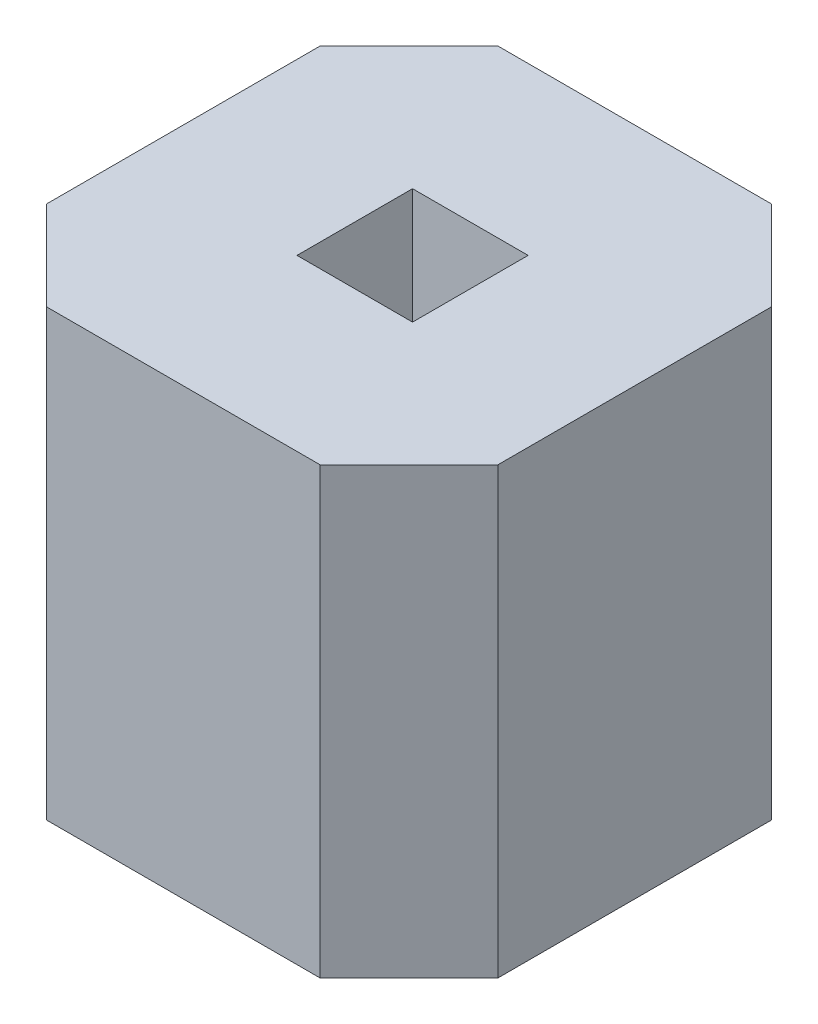
ISO-10303-21;
HEADER;
FILE_DESCRIPTION(('STEP AP214'),'2;1');
FILE_NAME('part.step','',(''),(''),'','','');
FILE_SCHEMA(('AUTOMOTIVE_DESIGN { 1 0 10303 214 1 1 1 1 }'));
ENDSEC;
DATA;
#1=APPLICATION_CONTEXT('core data for automotive mechanical design processes');
#2=APPLICATION_PROTOCOL_DEFINITION('international standard','automotive_design',2000,#1);
#3=PRODUCT_CONTEXT('',#1,'mechanical');
#4=PRODUCT('Part','Part','',(#3));
#5=PRODUCT_RELATED_PRODUCT_CATEGORY('part','',(#4));
#6=PRODUCT_DEFINITION_FORMATION('','',#4);
#7=PRODUCT_DEFINITION_CONTEXT('part definition',#1,'design');
#8=PRODUCT_DEFINITION('design','',#6,#7);
#9=PRODUCT_DEFINITION_SHAPE('','',#8);
#10=(LENGTH_UNIT() NAMED_UNIT(*) SI_UNIT(.MILLI.,.METRE.));
#11=(NAMED_UNIT(*) PLANE_ANGLE_UNIT() SI_UNIT($,.RADIAN.));
#12=(NAMED_UNIT(*) SI_UNIT($,.STERADIAN.) SOLID_ANGLE_UNIT());
#13=UNCERTAINTY_MEASURE_WITH_UNIT(LENGTH_MEASURE(1.E-05),#10,'distance_accuracy_value','');
#14=(GEOMETRIC_REPRESENTATION_CONTEXT(3) GLOBAL_UNCERTAINTY_ASSIGNED_CONTEXT((#13)) GLOBAL_UNIT_ASSIGNED_CONTEXT((#10,
#11,#12)) REPRESENTATION_CONTEXT('',''));
#15=CARTESIAN_POINT('',(0.,0.,0.));
#16=DIRECTION('',(0.,0.,1.));
#17=DIRECTION('',(1.,0.,0.));
#18=AXIS2_PLACEMENT_3D('',#15,#16,#17);
#19=CARTESIAN_POINT('',(2.54,2.5,-2.54));
#20=DIRECTION('',(0.,1.,0.));
#21=DIRECTION('',(0.,0.,1.));
#22=AXIS2_PLACEMENT_3D('',#19,#20,#21);
#23=PLANE('',#22);
#24=DIRECTION('',(-1.,0.,0.));
#25=VECTOR('',#24,1.);
#26=CARTESIAN_POINT('',(0.5,2.5,-2.54));
#27=LINE('',#26,#25);
#28=CARTESIAN_POINT('',(2.04,2.5,-2.54));
#29=VERTEX_POINT('',#28);
#30=CARTESIAN_POINT('',(0.5,2.5,-2.54));
#31=VERTEX_POINT('',#30);
#32=EDGE_CURVE('E157',#29,#31,#27,.T.);
#33=ORIENTED_EDGE('',*,*,#32,.T.);
#34=DIRECTION('',(-0.707106781186548,0.,0.707106781186548));
#35=VECTOR('',#34,1.);
#36=CARTESIAN_POINT('',(0.,2.5,-2.04));
#37=LINE('',#36,#35);
#38=CARTESIAN_POINT('',(0.,2.5,-2.04));
#39=VERTEX_POINT('',#38);
#40=EDGE_CURVE('E160',#31,#39,#37,.T.);
#41=ORIENTED_EDGE('',*,*,#40,.T.);
#42=DIRECTION('',(0.,0.,1.));
#43=VECTOR('',#42,1.);
#44=CARTESIAN_POINT('',(0.,2.5,-0.5));
#45=LINE('',#44,#43);
#46=CARTESIAN_POINT('',(0.,2.5,-0.5));
#47=VERTEX_POINT('',#46);
#48=EDGE_CURVE('E163',#39,#47,#45,.T.);
#49=ORIENTED_EDGE('',*,*,#48,.T.);
#50=DIRECTION('',(0.707106781186548,0.,0.707106781186548));
#51=VECTOR('',#50,1.);
#52=CARTESIAN_POINT('',(0.5,2.5,0.));
#53=LINE('',#52,#51);
#54=CARTESIAN_POINT('',(0.5,2.5,0.));
#55=VERTEX_POINT('',#54);
#56=EDGE_CURVE('E165',#47,#55,#53,.T.);
#57=ORIENTED_EDGE('',*,*,#56,.T.);
#58=DIRECTION('',(1.,0.,0.));
#59=VECTOR('',#58,1.);
#60=CARTESIAN_POINT('',(0.5,2.5,0.));
#61=LINE('',#60,#59);
#62=CARTESIAN_POINT('',(2.04,2.5,0.));
#63=VERTEX_POINT('',#62);
#64=EDGE_CURVE('E167',#55,#63,#61,.T.);
#65=ORIENTED_EDGE('',*,*,#64,.T.);
#66=DIRECTION('',(0.707106781186548,0.,-0.707106781186548));
#67=VECTOR('',#66,1.);
#68=CARTESIAN_POINT('',(2.04,2.5,0.));
#69=LINE('',#68,#67);
#70=CARTESIAN_POINT('',(2.54,2.5,-0.5));
#71=VERTEX_POINT('',#70);
#72=EDGE_CURVE('E169',#63,#71,#69,.T.);
#73=ORIENTED_EDGE('',*,*,#72,.T.);
#74=DIRECTION('',(0.,0.,-1.));
#75=VECTOR('',#74,1.);
#76=CARTESIAN_POINT('',(2.54,2.5,-0.5));
#77=LINE('',#76,#75);
#78=CARTESIAN_POINT('',(2.54,2.5,-2.04));
#79=VERTEX_POINT('',#78);
#80=EDGE_CURVE('E171',#71,#79,#77,.T.);
#81=ORIENTED_EDGE('',*,*,#80,.T.);
#82=DIRECTION('',(-0.707106781186548,0.,-0.707106781186548));
#83=VECTOR('',#82,1.);
#84=CARTESIAN_POINT('',(2.54,2.5,-2.04));
#85=LINE('',#84,#83);
#86=EDGE_CURVE('E173',#79,#29,#85,.T.);
#87=ORIENTED_EDGE('',*,*,#86,.T.);
#88=EDGE_LOOP('',(#33,#41,#49,#57,#65,#73,#81,#87));
#89=FACE_BOUND('',#88,.T.);
#90=DIRECTION('',(1.,0.,0.));
#91=VECTOR('',#90,1.);
#92=CARTESIAN_POINT('',(0.955,2.5,-0.955));
#93=LINE('',#92,#91);
#94=CARTESIAN_POINT('',(0.955,2.5,-0.955));
#95=VERTEX_POINT('',#94);
#96=CARTESIAN_POINT('',(1.605,2.5,-0.955));
#97=VERTEX_POINT('',#96);
#98=EDGE_CURVE('E129',#95,#97,#93,.T.);
#99=ORIENTED_EDGE('',*,*,#98,.F.);
#100=DIRECTION('',(0.,0.,1.));
#101=VECTOR('',#100,1.);
#102=CARTESIAN_POINT('',(0.955,2.5,-1.605));
#103=LINE('',#102,#101);
#104=CARTESIAN_POINT('',(0.955,2.5,-1.605));
#105=VERTEX_POINT('',#104);
#106=EDGE_CURVE('E121',#105,#95,#103,.T.);
#107=ORIENTED_EDGE('',*,*,#106,.F.);
#108=DIRECTION('',(-1.,0.,0.));
#109=VECTOR('',#108,1.);
#110=CARTESIAN_POINT('',(0.955,2.5,-1.605));
#111=LINE('',#110,#109);
#112=CARTESIAN_POINT('',(1.605,2.5,-1.605));
#113=VERTEX_POINT('',#112);
#114=EDGE_CURVE('E143',#113,#105,#111,.T.);
#115=ORIENTED_EDGE('',*,*,#114,.F.);
#116=DIRECTION('',(0.,0.,-1.));
#117=VECTOR('',#116,1.);
#118=CARTESIAN_POINT('',(1.605,2.5,-1.605));
#119=LINE('',#118,#117);
#120=EDGE_CURVE('E141',#97,#113,#119,.T.);
#121=ORIENTED_EDGE('',*,*,#120,.F.);
#122=EDGE_LOOP('',(#99,#107,#115,#121));
#123=FACE_BOUND('',#122,.T.);
#124=ADVANCED_FACE('F32',(#89,#123),#23,.T.);
#125=CARTESIAN_POINT('',(2.54,0.,-2.54));
#126=DIRECTION('',(0.,1.,0.));
#127=DIRECTION('',(0.,0.,1.));
#128=AXIS2_PLACEMENT_3D('',#125,#126,#127);
#129=PLANE('',#128);
#130=DIRECTION('',(-1.,0.,0.));
#131=VECTOR('',#130,1.);
#132=CARTESIAN_POINT('',(0.5,0.,-2.54));
#133=LINE('',#132,#131);
#134=CARTESIAN_POINT('',(2.04,0.,-2.54));
#135=VERTEX_POINT('',#134);
#136=CARTESIAN_POINT('',(0.5,0.,-2.54));
#137=VERTEX_POINT('',#136);
#138=EDGE_CURVE('E137',#135,#137,#133,.T.);
#139=ORIENTED_EDGE('',*,*,#138,.F.);
#140=DIRECTION('',(-0.707106781186548,0.,-0.707106781186548));
#141=VECTOR('',#140,1.);
#142=CARTESIAN_POINT('',(2.54,0.,-2.04));
#143=LINE('',#142,#141);
#144=CARTESIAN_POINT('',(2.54,0.,-2.04));
#145=VERTEX_POINT('',#144);
#146=EDGE_CURVE('E161',#145,#135,#143,.T.);
#147=ORIENTED_EDGE('',*,*,#146,.F.);
#148=DIRECTION('',(0.,0.,-1.));
#149=VECTOR('',#148,1.);
#150=CARTESIAN_POINT('',(2.54,0.,-0.5));
#151=LINE('',#150,#149);
#152=CARTESIAN_POINT('',(2.54,0.,-0.5));
#153=VERTEX_POINT('',#152);
#154=EDGE_CURVE('E188',#153,#145,#151,.T.);
#155=ORIENTED_EDGE('',*,*,#154,.F.);
#156=DIRECTION('',(0.707106781186548,0.,-0.707106781186548));
#157=VECTOR('',#156,1.);
#158=CARTESIAN_POINT('',(2.04,0.,0.));
#159=LINE('',#158,#157);
#160=CARTESIAN_POINT('',(2.04,0.,0.));
#161=VERTEX_POINT('',#160);
#162=EDGE_CURVE('E186',#161,#153,#159,.T.);
#163=ORIENTED_EDGE('',*,*,#162,.F.);
#164=DIRECTION('',(1.,0.,0.));
#165=VECTOR('',#164,1.);
#166=CARTESIAN_POINT('',(0.5,0.,0.));
#167=LINE('',#166,#165);
#168=CARTESIAN_POINT('',(0.5,0.,0.));
#169=VERTEX_POINT('',#168);
#170=EDGE_CURVE('E184',#169,#161,#167,.T.);
#171=ORIENTED_EDGE('',*,*,#170,.F.);
#172=DIRECTION('',(0.707106781186548,0.,0.707106781186548));
#173=VECTOR('',#172,1.);
#174=CARTESIAN_POINT('',(0.5,0.,0.));
#175=LINE('',#174,#173);
#176=CARTESIAN_POINT('',(0.,0.,-0.5));
#177=VERTEX_POINT('',#176);
#178=EDGE_CURVE('E182',#177,#169,#175,.T.);
#179=ORIENTED_EDGE('',*,*,#178,.F.);
#180=DIRECTION('',(0.,0.,1.));
#181=VECTOR('',#180,1.);
#182=CARTESIAN_POINT('',(0.,0.,-0.5));
#183=LINE('',#182,#181);
#184=CARTESIAN_POINT('',(0.,0.,-2.04));
#185=VERTEX_POINT('',#184);
#186=EDGE_CURVE('E180',#185,#177,#183,.T.);
#187=ORIENTED_EDGE('',*,*,#186,.F.);
#188=DIRECTION('',(-0.707106781186548,0.,0.707106781186548));
#189=VECTOR('',#188,1.);
#190=CARTESIAN_POINT('',(0.,0.,-2.04));
#191=LINE('',#190,#189);
#192=EDGE_CURVE('E178',#137,#185,#191,.T.);
#193=ORIENTED_EDGE('',*,*,#192,.F.);
#194=EDGE_LOOP('',(#139,#147,#155,#163,#171,#179,#187,#193));
#195=FACE_BOUND('',#194,.T.);
#196=DIRECTION('',(0.,0.,1.));
#197=VECTOR('',#196,1.);
#198=CARTESIAN_POINT('',(0.955,0.,-1.605));
#199=LINE('',#198,#197);
#200=CARTESIAN_POINT('',(0.955,0.,-1.605));
#201=VERTEX_POINT('',#200);
#202=CARTESIAN_POINT('',(0.955,0.,-0.955));
#203=VERTEX_POINT('',#202);
#204=EDGE_CURVE('E55',#201,#203,#199,.T.);
#205=ORIENTED_EDGE('',*,*,#204,.T.);
#206=DIRECTION('',(1.,0.,0.));
#207=VECTOR('',#206,1.);
#208=CARTESIAN_POINT('',(0.955,0.,-0.955));
#209=LINE('',#208,#207);
#210=CARTESIAN_POINT('',(1.605,0.,-0.955));
#211=VERTEX_POINT('',#210);
#212=EDGE_CURVE('E136',#203,#211,#209,.T.);
#213=ORIENTED_EDGE('',*,*,#212,.T.);
#214=DIRECTION('',(0.,0.,-1.));
#215=VECTOR('',#214,1.);
#216=CARTESIAN_POINT('',(1.605,0.,-1.605));
#217=LINE('',#216,#215);
#218=CARTESIAN_POINT('',(1.605,0.,-1.605));
#219=VERTEX_POINT('',#218);
#220=EDGE_CURVE('E149',#211,#219,#217,.T.);
#221=ORIENTED_EDGE('',*,*,#220,.T.);
#222=DIRECTION('',(-1.,0.,0.));
#223=VECTOR('',#222,1.);
#224=CARTESIAN_POINT('',(0.955,0.,-1.605));
#225=LINE('',#224,#223);
#226=EDGE_CURVE('E130',#219,#201,#225,.T.);
#227=ORIENTED_EDGE('',*,*,#226,.T.);
#228=EDGE_LOOP('',(#205,#213,#221,#227));
#229=FACE_BOUND('',#228,.T.);
#230=ADVANCED_FACE('F218',(#195,#229),#129,.F.);
#231=CARTESIAN_POINT('',(0.5,2.5,-2.54));
#232=DIRECTION('',(0.,0.,1.));
#233=DIRECTION('',(1.,0.,0.));
#234=AXIS2_PLACEMENT_3D('',#231,#232,#233);
#235=PLANE('',#234);
#236=ORIENTED_EDGE('',*,*,#138,.T.);
#237=DIRECTION('',(0.,-1.,0.));
#238=VECTOR('',#237,1.);
#239=CARTESIAN_POINT('',(0.5,2.5,-2.54));
#240=LINE('',#239,#238);
#241=EDGE_CURVE('E11',#31,#137,#240,.T.);
#242=ORIENTED_EDGE('',*,*,#241,.F.);
#243=ORIENTED_EDGE('',*,*,#32,.F.);
#244=DIRECTION('',(0.,-1.,0.));
#245=VECTOR('',#244,1.);
#246=CARTESIAN_POINT('',(2.04,2.5,-2.54));
#247=LINE('',#246,#245);
#248=EDGE_CURVE('E175',#29,#135,#247,.T.);
#249=ORIENTED_EDGE('',*,*,#248,.T.);
#250=EDGE_LOOP('',(#236,#242,#243,#249));
#251=FACE_BOUND('',#250,.T.);
#252=ADVANCED_FACE('F34',(#251),#235,.F.);
#253=CARTESIAN_POINT('',(0.,2.5,-2.04));
#254=DIRECTION('',(0.707106781186548,0.,0.707106781186548));
#255=DIRECTION('',(0.707106781186548,0.,-0.707106781186548));
#256=AXIS2_PLACEMENT_3D('',#253,#254,#255);
#257=PLANE('',#256);
#258=ORIENTED_EDGE('',*,*,#192,.T.);
#259=DIRECTION('',(0.,-1.,0.));
#260=VECTOR('',#259,1.);
#261=CARTESIAN_POINT('',(0.,2.5,-2.04));
#262=LINE('',#261,#260);
#263=EDGE_CURVE('E40',#39,#185,#262,.T.);
#264=ORIENTED_EDGE('',*,*,#263,.F.);
#265=ORIENTED_EDGE('',*,*,#40,.F.);
#266=ORIENTED_EDGE('',*,*,#241,.T.);
#267=EDGE_LOOP('',(#258,#264,#265,#266));
#268=FACE_BOUND('',#267,.T.);
#269=ADVANCED_FACE('F235',(#268),#257,.F.);
#270=CARTESIAN_POINT('',(0.,2.5,-0.5));
#271=DIRECTION('',(1.,0.,0.));
#272=DIRECTION('',(0.,0.,-1.));
#273=AXIS2_PLACEMENT_3D('',#270,#271,#272);
#274=PLANE('',#273);
#275=ORIENTED_EDGE('',*,*,#186,.T.);
#276=DIRECTION('',(0.,-1.,0.));
#277=VECTOR('',#276,1.);
#278=CARTESIAN_POINT('',(0.,2.5,-0.5));
#279=LINE('',#278,#277);
#280=EDGE_CURVE('E205',#47,#177,#279,.T.);
#281=ORIENTED_EDGE('',*,*,#280,.F.);
#282=ORIENTED_EDGE('',*,*,#48,.F.);
#283=ORIENTED_EDGE('',*,*,#263,.T.);
#284=EDGE_LOOP('',(#275,#281,#282,#283));
#285=FACE_BOUND('',#284,.T.);
#286=ADVANCED_FACE('F212',(#285),#274,.F.);
#287=CARTESIAN_POINT('',(0.5,2.5,0.));
#288=DIRECTION('',(0.707106781186548,0.,-0.707106781186548));
#289=DIRECTION('',(-0.707106781186548,0.,-0.707106781186548));
#290=AXIS2_PLACEMENT_3D('',#287,#288,#289);
#291=PLANE('',#290);
#292=ORIENTED_EDGE('',*,*,#178,.T.);
#293=DIRECTION('',(0.,-1.,0.));
#294=VECTOR('',#293,1.);
#295=CARTESIAN_POINT('',(0.5,2.5,0.));
#296=LINE('',#295,#294);
#297=EDGE_CURVE('E202',#55,#169,#296,.T.);
#298=ORIENTED_EDGE('',*,*,#297,.F.);
#299=ORIENTED_EDGE('',*,*,#56,.F.);
#300=ORIENTED_EDGE('',*,*,#280,.T.);
#301=EDGE_LOOP('',(#292,#298,#299,#300));
#302=FACE_BOUND('',#301,.T.);
#303=ADVANCED_FACE('F224',(#302),#291,.F.);
#304=CARTESIAN_POINT('',(0.5,2.5,0.));
#305=DIRECTION('',(0.,0.,-1.));
#306=DIRECTION('',(-1.,0.,0.));
#307=AXIS2_PLACEMENT_3D('',#304,#305,#306);
#308=PLANE('',#307);
#309=ORIENTED_EDGE('',*,*,#170,.T.);
#310=DIRECTION('',(0.,-1.,0.));
#311=VECTOR('',#310,1.);
#312=CARTESIAN_POINT('',(2.04,2.5,0.));
#313=LINE('',#312,#311);
#314=EDGE_CURVE('E199',#63,#161,#313,.T.);
#315=ORIENTED_EDGE('',*,*,#314,.F.);
#316=ORIENTED_EDGE('',*,*,#64,.F.);
#317=ORIENTED_EDGE('',*,*,#297,.T.);
#318=EDGE_LOOP('',(#309,#315,#316,#317));
#319=FACE_BOUND('',#318,.T.);
#320=ADVANCED_FACE('F228',(#319),#308,.F.);
#321=CARTESIAN_POINT('',(2.04,2.5,0.));
#322=DIRECTION('',(-0.707106781186548,0.,-0.707106781186548));
#323=DIRECTION('',(-0.707106781186548,0.,0.707106781186548));
#324=AXIS2_PLACEMENT_3D('',#321,#322,#323);
#325=PLANE('',#324);
#326=ORIENTED_EDGE('',*,*,#162,.T.);
#327=DIRECTION('',(0.,-1.,0.));
#328=VECTOR('',#327,1.);
#329=CARTESIAN_POINT('',(2.54,2.5,-0.5));
#330=LINE('',#329,#328);
#331=EDGE_CURVE('E196',#71,#153,#330,.T.);
#332=ORIENTED_EDGE('',*,*,#331,.F.);
#333=ORIENTED_EDGE('',*,*,#72,.F.);
#334=ORIENTED_EDGE('',*,*,#314,.T.);
#335=EDGE_LOOP('',(#326,#332,#333,#334));
#336=FACE_BOUND('',#335,.T.);
#337=ADVANCED_FACE('F248',(#336),#325,.F.);
#338=CARTESIAN_POINT('',(2.54,2.5,-0.5));
#339=DIRECTION('',(-1.,0.,0.));
#340=DIRECTION('',(0.,0.,1.));
#341=AXIS2_PLACEMENT_3D('',#338,#339,#340);
#342=PLANE('',#341);
#343=ORIENTED_EDGE('',*,*,#154,.T.);
#344=DIRECTION('',(0.,-1.,0.));
#345=VECTOR('',#344,1.);
#346=CARTESIAN_POINT('',(2.54,2.5,-2.04));
#347=LINE('',#346,#345);
#348=EDGE_CURVE('E193',#79,#145,#347,.T.);
#349=ORIENTED_EDGE('',*,*,#348,.F.);
#350=ORIENTED_EDGE('',*,*,#80,.F.);
#351=ORIENTED_EDGE('',*,*,#331,.T.);
#352=EDGE_LOOP('',(#343,#349,#350,#351));
#353=FACE_BOUND('',#352,.T.);
#354=ADVANCED_FACE('F246',(#353),#342,.F.);
#355=CARTESIAN_POINT('',(2.54,2.5,-2.04));
#356=DIRECTION('',(-0.707106781186548,0.,0.707106781186548));
#357=DIRECTION('',(0.707106781186548,0.,0.707106781186548));
#358=AXIS2_PLACEMENT_3D('',#355,#356,#357);
#359=PLANE('',#358);
#360=ORIENTED_EDGE('',*,*,#146,.T.);
#361=ORIENTED_EDGE('',*,*,#248,.F.);
#362=ORIENTED_EDGE('',*,*,#86,.F.);
#363=ORIENTED_EDGE('',*,*,#348,.T.);
#364=EDGE_LOOP('',(#360,#361,#362,#363));
#365=FACE_BOUND('',#364,.T.);
#366=ADVANCED_FACE('F241',(#365),#359,.F.);
#367=CARTESIAN_POINT('',(0.955,2.5,-1.605));
#368=DIRECTION('',(1.,0.,0.));
#369=DIRECTION('',(0.,0.,-1.));
#370=AXIS2_PLACEMENT_3D('',#367,#368,#369);
#371=PLANE('',#370);
#372=ORIENTED_EDGE('',*,*,#204,.F.);
#373=DIRECTION('',(0.,-1.,0.));
#374=VECTOR('',#373,1.);
#375=CARTESIAN_POINT('',(0.955,2.5,-1.605));
#376=LINE('',#375,#374);
#377=EDGE_CURVE('E125',#105,#201,#376,.T.);
#378=ORIENTED_EDGE('',*,*,#377,.F.);
#379=ORIENTED_EDGE('',*,*,#106,.T.);
#380=DIRECTION('',(0.,-1.,0.));
#381=VECTOR('',#380,1.);
#382=CARTESIAN_POINT('',(0.955,2.5,-0.955));
#383=LINE('',#382,#381);
#384=EDGE_CURVE('E124',#95,#203,#383,.T.);
#385=ORIENTED_EDGE('',*,*,#384,.T.);
#386=EDGE_LOOP('',(#372,#378,#379,#385));
#387=FACE_BOUND('',#386,.T.);
#388=ADVANCED_FACE('F123',(#387),#371,.T.);
#389=CARTESIAN_POINT('',(0.955,2.5,-0.955));
#390=DIRECTION('',(0.,0.,-1.));
#391=DIRECTION('',(-1.,0.,0.));
#392=AXIS2_PLACEMENT_3D('',#389,#390,#391);
#393=PLANE('',#392);
#394=ORIENTED_EDGE('',*,*,#212,.F.);
#395=ORIENTED_EDGE('',*,*,#384,.F.);
#396=ORIENTED_EDGE('',*,*,#98,.T.);
#397=DIRECTION('',(0.,-1.,0.));
#398=VECTOR('',#397,1.);
#399=CARTESIAN_POINT('',(1.605,2.5,-0.955));
#400=LINE('',#399,#398);
#401=EDGE_CURVE('E138',#97,#211,#400,.T.);
#402=ORIENTED_EDGE('',*,*,#401,.T.);
#403=EDGE_LOOP('',(#394,#395,#396,#402));
#404=FACE_BOUND('',#403,.T.);
#405=ADVANCED_FACE('F133',(#404),#393,.T.);
#406=CARTESIAN_POINT('',(1.605,2.5,-1.605));
#407=DIRECTION('',(-1.,0.,0.));
#408=DIRECTION('',(0.,0.,1.));
#409=AXIS2_PLACEMENT_3D('',#406,#407,#408);
#410=PLANE('',#409);
#411=ORIENTED_EDGE('',*,*,#220,.F.);
#412=ORIENTED_EDGE('',*,*,#401,.F.);
#413=ORIENTED_EDGE('',*,*,#120,.T.);
#414=DIRECTION('',(0.,-1.,0.));
#415=VECTOR('',#414,1.);
#416=CARTESIAN_POINT('',(1.605,2.5,-1.605));
#417=LINE('',#416,#415);
#418=EDGE_CURVE('E47',#113,#219,#417,.T.);
#419=ORIENTED_EDGE('',*,*,#418,.T.);
#420=EDGE_LOOP('',(#411,#412,#413,#419));
#421=FACE_BOUND('',#420,.T.);
#422=ADVANCED_FACE('F273',(#421),#410,.T.);
#423=CARTESIAN_POINT('',(0.955,2.5,-1.605));
#424=DIRECTION('',(0.,0.,1.));
#425=DIRECTION('',(1.,0.,0.));
#426=AXIS2_PLACEMENT_3D('',#423,#424,#425);
#427=PLANE('',#426);
#428=ORIENTED_EDGE('',*,*,#226,.F.);
#429=ORIENTED_EDGE('',*,*,#418,.F.);
#430=ORIENTED_EDGE('',*,*,#114,.T.);
#431=ORIENTED_EDGE('',*,*,#377,.T.);
#432=EDGE_LOOP('',(#428,#429,#430,#431));
#433=FACE_BOUND('',#432,.T.);
#434=ADVANCED_FACE('F277',(#433),#427,.T.);
#435=CLOSED_SHELL('',(#124,#230,#252,#269,#286,#303,#320,#337,#354,#366,#388,#405,#422,#434));
#436=MANIFOLD_SOLID_BREP('B2',#435);
#437=ADVANCED_BREP_SHAPE_REPRESENTATION('',(#18,#436),#14);
#438=SHAPE_DEFINITION_REPRESENTATION(#9,#437);
ENDSEC;
END-ISO-10303-21;
